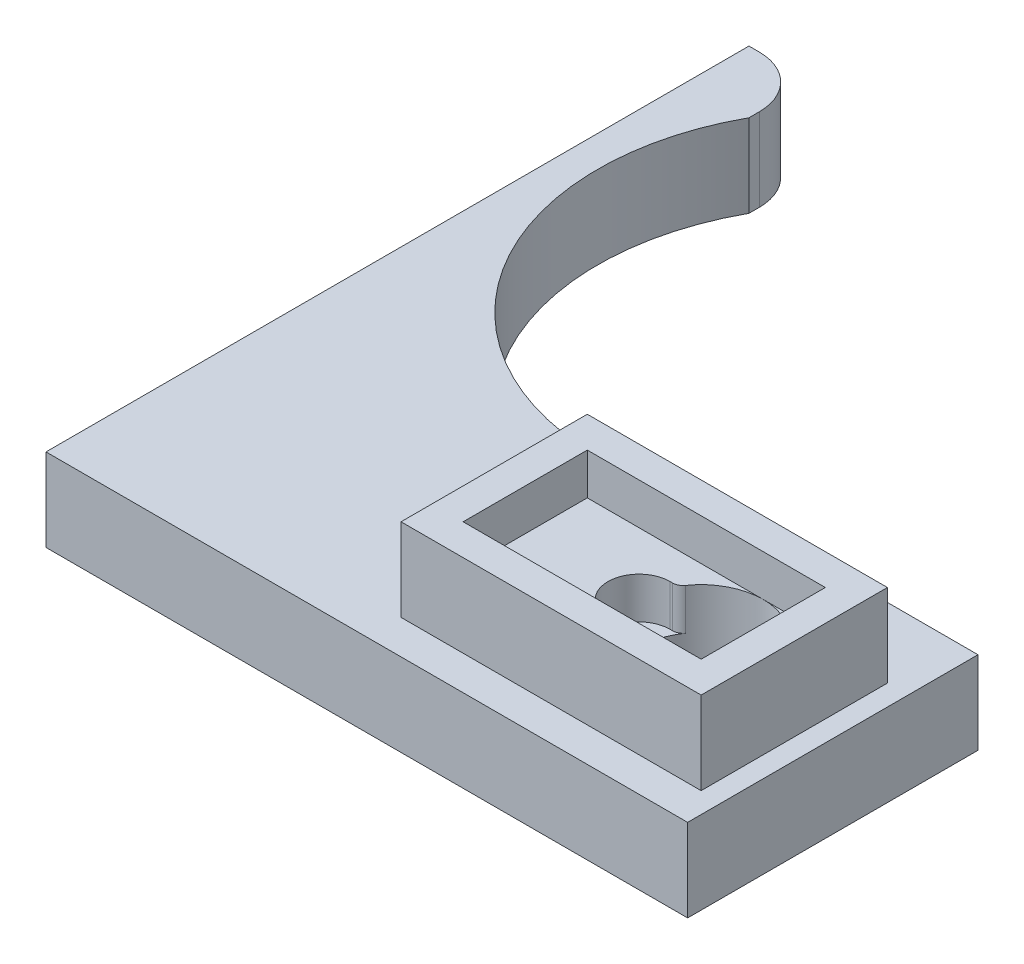
ISO-10303-21;
HEADER;
FILE_DESCRIPTION(('STEP AP214'),'2;1');
FILE_NAME('part.step','',(''),(''),'','','');
FILE_SCHEMA(('AUTOMOTIVE_DESIGN { 1 0 10303 214 1 1 1 1 }'));
ENDSEC;
DATA;
#1=APPLICATION_CONTEXT('core data for automotive mechanical design processes');
#2=APPLICATION_PROTOCOL_DEFINITION('international standard','automotive_design',2000,#1);
#3=PRODUCT_CONTEXT('',#1,'mechanical');
#4=PRODUCT('Part','Part','',(#3));
#5=PRODUCT_RELATED_PRODUCT_CATEGORY('part','',(#4));
#6=PRODUCT_DEFINITION_FORMATION('','',#4);
#7=PRODUCT_DEFINITION_CONTEXT('part definition',#1,'design');
#8=PRODUCT_DEFINITION('design','',#6,#7);
#9=PRODUCT_DEFINITION_SHAPE('','',#8);
#10=(LENGTH_UNIT() NAMED_UNIT(*) SI_UNIT(.MILLI.,.METRE.));
#11=(NAMED_UNIT(*) PLANE_ANGLE_UNIT() SI_UNIT($,.RADIAN.));
#12=(NAMED_UNIT(*) SI_UNIT($,.STERADIAN.) SOLID_ANGLE_UNIT());
#13=UNCERTAINTY_MEASURE_WITH_UNIT(LENGTH_MEASURE(1.E-05),#10,'distance_accuracy_value','');
#14=(GEOMETRIC_REPRESENTATION_CONTEXT(3) GLOBAL_UNCERTAINTY_ASSIGNED_CONTEXT((#13)) GLOBAL_UNIT_ASSIGNED_CONTEXT((#10,
#11,#12)) REPRESENTATION_CONTEXT('',''));
#15=CARTESIAN_POINT('',(0.,0.,0.));
#16=DIRECTION('',(0.,0.,1.));
#17=DIRECTION('',(1.,0.,0.));
#18=AXIS2_PLACEMENT_3D('',#15,#16,#17);
#19=CARTESIAN_POINT('',(0.,12.,0.));
#20=DIRECTION('',(0.,-1.,0.));
#21=DIRECTION('',(0.,0.,-1.));
#22=AXIS2_PLACEMENT_3D('',#19,#20,#21);
#23=PLANE('',#22);
#24=DIRECTION('',(-1.,0.,0.));
#25=VECTOR('',#24,1.);
#26=CARTESIAN_POINT('',(34.,12.,-18.3045831922197));
#27=LINE('',#26,#25);
#28=CARTESIAN_POINT('',(51.,12.,-18.3045831922197));
#29=VERTEX_POINT('',#28);
#30=CARTESIAN_POINT('',(34.,12.,-18.3045831922197));
#31=VERTEX_POINT('',#30);
#32=EDGE_CURVE('E302',#29,#31,#27,.T.);
#33=ORIENTED_EDGE('',*,*,#32,.T.);
#34=DIRECTION('',(0.,0.,1.));
#35=VECTOR('',#34,1.);
#36=CARTESIAN_POINT('',(34.,12.,-18.3045831922197));
#37=LINE('',#36,#35);
#38=CARTESIAN_POINT('',(34.,12.,-6.30458319221971));
#39=VERTEX_POINT('',#38);
#40=EDGE_CURVE('E278',#31,#39,#37,.T.);
#41=ORIENTED_EDGE('',*,*,#40,.T.);
#42=DIRECTION('',(1.,0.,0.));
#43=VECTOR('',#42,1.);
#44=CARTESIAN_POINT('',(34.,12.,-6.30458319221971));
#45=LINE('',#44,#43);
#46=CARTESIAN_POINT('',(51.,12.,-6.30458319221971));
#47=VERTEX_POINT('',#46);
#48=EDGE_CURVE('E292',#39,#47,#45,.T.);
#49=ORIENTED_EDGE('',*,*,#48,.T.);
#50=CARTESIAN_POINT('',(51.,12.,-12.3045831922197));
#51=DIRECTION('',(0.,-1.,0.));
#52=DIRECTION('',(0.,0.,-1.));
#53=AXIS2_PLACEMENT_3D('',#50,#51,#52);
#54=CIRCLE('',#53,5.99999999999999);
#55=CARTESIAN_POINT('',(46.0760891601103,12.,-8.87601176364829));
#56=VERTEX_POINT('',#55);
#57=EDGE_CURVE('E331',#47,#56,#54,.T.);
#58=ORIENTED_EDGE('',*,*,#57,.T.);
#59=CARTESIAN_POINT('',(45.255437353462,12.,-8.30458319221972));
#60=DIRECTION('',(0.,-1.,0.));
#61=DIRECTION('',(0.,0.,-1.));
#62=AXIS2_PLACEMENT_3D('',#59,#60,#61);
#63=CIRCLE('',#62,1.);
#64=CARTESIAN_POINT('',(45.255437353462,12.,-9.30458319221972));
#65=VERTEX_POINT('',#64);
#66=EDGE_CURVE('E335',#65,#56,#63,.T.);
#67=ORIENTED_EDGE('',*,*,#66,.F.);
#68=DIRECTION('',(1.,0.,0.));
#69=VECTOR('',#68,1.);
#70=CARTESIAN_POINT('',(45.,12.,-9.30458319221972));
#71=LINE('',#70,#69);
#72=CARTESIAN_POINT('',(45.,12.,-9.30458319221972));
#73=VERTEX_POINT('',#72);
#74=EDGE_CURVE('E339',#73,#65,#71,.T.);
#75=ORIENTED_EDGE('',*,*,#74,.F.);
#76=CARTESIAN_POINT('',(45.,12.,-12.3045831922197));
#77=DIRECTION('',(0.,1.,0.));
#78=DIRECTION('',(0.,0.,1.));
#79=AXIS2_PLACEMENT_3D('',#76,#77,#78);
#80=CIRCLE('',#79,3.);
#81=CARTESIAN_POINT('',(45.,12.,-15.3045831922197));
#82=VERTEX_POINT('',#81);
#83=EDGE_CURVE('E341',#82,#73,#80,.T.);
#84=ORIENTED_EDGE('',*,*,#83,.F.);
#85=DIRECTION('',(1.,0.,0.));
#86=VECTOR('',#85,1.);
#87=CARTESIAN_POINT('',(45.,12.,-15.3045831922197));
#88=LINE('',#87,#86);
#89=CARTESIAN_POINT('',(45.255437353462,12.,-15.3045831922197));
#90=VERTEX_POINT('',#89);
#91=EDGE_CURVE('E324',#82,#90,#88,.T.);
#92=ORIENTED_EDGE('',*,*,#91,.T.);
#93=CARTESIAN_POINT('',(45.255437353462,12.,-16.3045831922197));
#94=DIRECTION('',(0.,1.,0.));
#95=DIRECTION('',(0.,0.,1.));
#96=AXIS2_PLACEMENT_3D('',#93,#94,#95);
#97=CIRCLE('',#96,1.);
#98=CARTESIAN_POINT('',(46.0760891601103,12.,-15.7331546207911));
#99=VERTEX_POINT('',#98);
#100=EDGE_CURVE('E327',#90,#99,#97,.T.);
#101=ORIENTED_EDGE('',*,*,#100,.T.);
#102=EDGE_CURVE('E332',#99,#29,#54,.T.);
#103=ORIENTED_EDGE('',*,*,#102,.T.);
#104=EDGE_LOOP('',(#33,#41,#49,#58,#67,#75,#84,#92,#101,#103));
#105=FACE_BOUND('',#104,.T.);
#106=ADVANCED_FACE('F71',(#105),#23,.F.);
#107=CARTESIAN_POINT('',(57.,12.,-12.3045831922197));
#108=VERTEX_POINT('',#107);
#109=EDGE_CURVE('E815',#108,#47,#54,.T.);
#110=ORIENTED_EDGE('',*,*,#109,.T.);
#111=CARTESIAN_POINT('',(57.,12.,-6.30458319221971));
#112=VERTEX_POINT('',#111);
#113=EDGE_CURVE('E296',#47,#112,#45,.T.);
#114=ORIENTED_EDGE('',*,*,#113,.T.);
#115=DIRECTION('',(0.,0.,-1.));
#116=VECTOR('',#115,1.);
#117=CARTESIAN_POINT('',(57.,12.,-18.3045831922197));
#118=LINE('',#117,#116);
#119=EDGE_CURVE('E295',#112,#108,#118,.T.);
#120=ORIENTED_EDGE('',*,*,#119,.T.);
#121=EDGE_LOOP('',(#110,#114,#120));
#122=FACE_BOUND('',#121,.T.);
#123=ADVANCED_FACE('F506',(#122),#23,.F.);
#124=CARTESIAN_POINT('',(1.,8.,-62.923533230842));
#125=DIRECTION('',(0.,-1.,0.));
#126=DIRECTION('',(0.,0.,-1.));
#127=AXIS2_PLACEMENT_3D('',#124,#125,#126);
#128=PLANE('',#127);
#129=DIRECTION('',(0.,0.,1.));
#130=VECTOR('',#129,1.);
#131=CARTESIAN_POINT('',(0.,8.,0.));
#132=LINE('',#131,#130);
#133=CARTESIAN_POINT('',(0.,8.,-67.923533230842));
#134=VERTEX_POINT('',#133);
#135=CARTESIAN_POINT('',(0.,8.,0.));
#136=VERTEX_POINT('',#135);
#137=EDGE_CURVE('E398',#134,#136,#132,.T.);
#138=ORIENTED_EDGE('',*,*,#137,.T.);
#139=DIRECTION('',(1.,0.,0.));
#140=VECTOR('',#139,1.);
#141=CARTESIAN_POINT('',(0.,8.,0.));
#142=LINE('',#141,#140);
#143=CARTESIAN_POINT('',(62.,8.,0.));
#144=VERTEX_POINT('',#143);
#145=EDGE_CURVE('E401',#136,#144,#142,.T.);
#146=ORIENTED_EDGE('',*,*,#145,.T.);
#147=DIRECTION('',(0.,0.,-1.));
#148=VECTOR('',#147,1.);
#149=CARTESIAN_POINT('',(62.,8.,-28.0559877309327));
#150=LINE('',#149,#148);
#151=CARTESIAN_POINT('',(62.,8.,-28.0559877309327));
#152=VERTEX_POINT('',#151);
#153=EDGE_CURVE('E404',#144,#152,#150,.T.);
#154=ORIENTED_EDGE('',*,*,#153,.T.);
#155=DIRECTION('',(-1.,0.,0.));
#156=VECTOR('',#155,1.);
#157=CARTESIAN_POINT('',(36.,8.,-28.0559877309327));
#158=LINE('',#157,#156);
#159=CARTESIAN_POINT('',(36.,8.,-28.0559877309327));
#160=VERTEX_POINT('',#159);
#161=EDGE_CURVE('E406',#152,#160,#158,.T.);
#162=ORIENTED_EDGE('',*,*,#161,.T.);
#163=CARTESIAN_POINT('',(27.,8.,-50.3045831922197));
#164=DIRECTION('',(0.,-1.,0.));
#165=DIRECTION('',(0.,0.,1.));
#166=AXIS2_PLACEMENT_3D('',#163,#164,#165);
#167=CIRCLE('',#166,24.);
#168=CARTESIAN_POINT('',(6.,8.,-61.923533230842));
#169=VERTEX_POINT('',#168);
#170=EDGE_CURVE('E408',#160,#169,#167,.T.);
#171=ORIENTED_EDGE('',*,*,#170,.T.);
#172=DIRECTION('',(0.,0.,-1.));
#173=VECTOR('',#172,1.);
#174=CARTESIAN_POINT('',(6.,8.,-61.923533230842));
#175=LINE('',#174,#173);
#176=CARTESIAN_POINT('',(6.,8.,-62.9235332308419));
#177=VERTEX_POINT('',#176);
#178=EDGE_CURVE('E410',#169,#177,#175,.T.);
#179=ORIENTED_EDGE('',*,*,#178,.T.);
#180=CARTESIAN_POINT('',(1.,8.,-62.923533230842));
#181=DIRECTION('',(0.,1.,0.));
#182=DIRECTION('',(0.,0.,-1.));
#183=AXIS2_PLACEMENT_3D('',#180,#181,#182);
#184=CIRCLE('',#183,5.);
#185=CARTESIAN_POINT('',(0.999999999999964,8.,-67.923533230842));
#186=VERTEX_POINT('',#185);
#187=EDGE_CURVE('E412',#177,#186,#184,.T.);
#188=ORIENTED_EDGE('',*,*,#187,.T.);
#189=DIRECTION('',(-1.,0.,0.));
#190=VECTOR('',#189,1.);
#191=CARTESIAN_POINT('',(0.,8.,-67.923533230842));
#192=LINE('',#191,#190);
#193=EDGE_CURVE('E414',#186,#134,#192,.T.);
#194=ORIENTED_EDGE('',*,*,#193,.T.);
#195=EDGE_LOOP('',(#138,#146,#154,#162,#171,#179,#188,#194));
#196=FACE_BOUND('',#195,.T.);
#197=DIRECTION('',(1.,0.,0.));
#198=VECTOR('',#197,1.);
#199=CARTESIAN_POINT('',(31.,8.,-3.30458319221972));
#200=LINE('',#199,#198);
#201=CARTESIAN_POINT('',(31.,8.,-3.30458319221972));
#202=VERTEX_POINT('',#201);
#203=CARTESIAN_POINT('',(60.,8.,-3.30458319221972));
#204=VERTEX_POINT('',#203);
#205=EDGE_CURVE('E357',#202,#204,#200,.T.);
#206=ORIENTED_EDGE('',*,*,#205,.F.);
#207=DIRECTION('',(0.,0.,1.));
#208=VECTOR('',#207,1.);
#209=CARTESIAN_POINT('',(31.,8.,-21.3045831922197));
#210=LINE('',#209,#208);
#211=CARTESIAN_POINT('',(31.,8.,-21.3045831922197));
#212=VERTEX_POINT('',#211);
#213=EDGE_CURVE('E379',#212,#202,#210,.T.);
#214=ORIENTED_EDGE('',*,*,#213,.F.);
#215=DIRECTION('',(1.,0.,0.));
#216=VECTOR('',#215,1.);
#217=CARTESIAN_POINT('',(31.,8.,-21.3045831922197));
#218=LINE('',#217,#216);
#219=CARTESIAN_POINT('',(60.,8.,-21.3045831922197));
#220=VERTEX_POINT('',#219);
#221=EDGE_CURVE('E376',#212,#220,#218,.T.);
#222=ORIENTED_EDGE('',*,*,#221,.T.);
#223=DIRECTION('',(0.,0.,1.));
#224=VECTOR('',#223,1.);
#225=CARTESIAN_POINT('',(60.,8.,-21.3045831922197));
#226=LINE('',#225,#224);
#227=EDGE_CURVE('E373',#220,#204,#226,.T.);
#228=ORIENTED_EDGE('',*,*,#227,.T.);
#229=EDGE_LOOP('',(#206,#214,#222,#228));
#230=FACE_BOUND('',#229,.T.);
#231=ADVANCED_FACE('F502',(#196,#230),#128,.F.);
#232=DIRECTION('',(1.,0.,0.));
#233=VECTOR('',#232,1.);
#234=CARTESIAN_POINT('',(45.,8.,-9.30458319221972));
#235=LINE('',#234,#233);
#236=CARTESIAN_POINT('',(45.,8.,-9.30458319221972));
#237=VERTEX_POINT('',#236);
#238=CARTESIAN_POINT('',(45.255437353462,8.,-9.30458319221972));
#239=VERTEX_POINT('',#238);
#240=EDGE_CURVE('E351',#237,#239,#235,.T.);
#241=ORIENTED_EDGE('',*,*,#240,.T.);
#242=CARTESIAN_POINT('',(45.255437353462,8.,-8.30458319221972));
#243=DIRECTION('',(0.,-1.,0.));
#244=DIRECTION('',(0.,0.,-1.));
#245=AXIS2_PLACEMENT_3D('',#242,#243,#244);
#246=CIRCLE('',#245,1.);
#247=CARTESIAN_POINT('',(46.0760891601103,8.,-8.87601176364829));
#248=VERTEX_POINT('',#247);
#249=EDGE_CURVE('E349',#239,#248,#246,.T.);
#250=ORIENTED_EDGE('',*,*,#249,.T.);
#251=CARTESIAN_POINT('',(51.,8.,-12.3045831922197));
#252=DIRECTION('',(0.,1.,0.));
#253=DIRECTION('',(0.,0.,1.));
#254=AXIS2_PLACEMENT_3D('',#251,#252,#253);
#255=CIRCLE('',#254,5.99999999999999);
#256=CARTESIAN_POINT('',(46.0760891601103,8.,-15.7331546207911));
#257=VERTEX_POINT('',#256);
#258=EDGE_CURVE('E392',#257,#248,#255,.T.);
#259=ORIENTED_EDGE('',*,*,#258,.F.);
#260=CARTESIAN_POINT('',(45.255437353462,8.,-16.3045831922197));
#261=DIRECTION('',(0.,1.,0.));
#262=DIRECTION('',(0.,0.,1.));
#263=AXIS2_PLACEMENT_3D('',#260,#261,#262);
#264=CIRCLE('',#263,1.);
#265=CARTESIAN_POINT('',(45.255437353462,8.,-15.3045831922197));
#266=VERTEX_POINT('',#265);
#267=EDGE_CURVE('E346',#266,#257,#264,.T.);
#268=ORIENTED_EDGE('',*,*,#267,.F.);
#269=DIRECTION('',(1.,0.,0.));
#270=VECTOR('',#269,1.);
#271=CARTESIAN_POINT('',(45.,8.,-15.3045831922197));
#272=LINE('',#271,#270);
#273=CARTESIAN_POINT('',(45.,8.,-15.3045831922197));
#274=VERTEX_POINT('',#273);
#275=EDGE_CURVE('E323',#274,#266,#272,.T.);
#276=ORIENTED_EDGE('',*,*,#275,.F.);
#277=CARTESIAN_POINT('',(45.,8.,-12.3045831922197));
#278=DIRECTION('',(0.,1.,0.));
#279=DIRECTION('',(0.,0.,1.));
#280=AXIS2_PLACEMENT_3D('',#277,#278,#279);
#281=CIRCLE('',#280,3.);
#282=EDGE_CURVE('E328',#274,#237,#281,.T.);
#283=ORIENTED_EDGE('',*,*,#282,.T.);
#284=EDGE_LOOP('',(#241,#250,#259,#268,#276,#283));
#285=FACE_BOUND('',#284,.T.);
#286=ADVANCED_FACE('F505',(#285),#128,.F.);
#287=CARTESIAN_POINT('',(1.,0.,-62.923533230842));
#288=DIRECTION('',(0.,-1.,0.));
#289=DIRECTION('',(0.,0.,-1.));
#290=AXIS2_PLACEMENT_3D('',#287,#288,#289);
#291=PLANE('',#290);
#292=DIRECTION('',(-0.20791169081776,0.,0.978147600733805));
#293=VECTOR('',#292,1.);
#294=CARTESIAN_POINT('',(55.1937036086913,0.,-16.1622841222414));
#295=LINE('',#294,#293);
#296=CARTESIAN_POINT('',(57.721788353277,0.,-28.0559877309327));
#297=VERTEX_POINT('',#296);
#298=CARTESIAN_POINT('',(55.2697300548974,0.,-16.5199604301791));
#299=VERTEX_POINT('',#298);
#300=EDGE_CURVE('E259',#297,#299,#295,.T.);
#301=ORIENTED_EDGE('',*,*,#300,.F.);
#302=DIRECTION('',(-1.,0.,0.));
#303=VECTOR('',#302,1.);
#304=CARTESIAN_POINT('',(36.,0.,-28.0559877309327));
#305=LINE('',#304,#303);
#306=CARTESIAN_POINT('',(62.,0.,-28.0559877309327));
#307=VERTEX_POINT('',#306);
#308=EDGE_CURVE('E424',#307,#297,#305,.T.);
#309=ORIENTED_EDGE('',*,*,#308,.F.);
#310=DIRECTION('',(0.,0.,-1.));
#311=VECTOR('',#310,1.);
#312=CARTESIAN_POINT('',(62.,0.,-28.0559877309327));
#313=LINE('',#312,#311);
#314=CARTESIAN_POINT('',(62.,0.,0.));
#315=VERTEX_POINT('',#314);
#316=EDGE_CURVE('E421',#315,#307,#313,.T.);
#317=ORIENTED_EDGE('',*,*,#316,.F.);
#318=DIRECTION('',(1.,0.,0.));
#319=VECTOR('',#318,1.);
#320=CARTESIAN_POINT('',(36.,0.,0.));
#321=LINE('',#320,#319);
#322=CARTESIAN_POINT('',(0.,0.,0.));
#323=VERTEX_POINT('',#322);
#324=EDGE_CURVE('E419',#323,#315,#321,.T.);
#325=ORIENTED_EDGE('',*,*,#324,.F.);
#326=DIRECTION('',(0.,0.,1.));
#327=VECTOR('',#326,1.);
#328=CARTESIAN_POINT('',(0.,0.,0.));
#329=LINE('',#328,#327);
#330=CARTESIAN_POINT('',(0.,0.,-67.923533230842));
#331=VERTEX_POINT('',#330);
#332=EDGE_CURVE('E395',#331,#323,#329,.T.);
#333=ORIENTED_EDGE('',*,*,#332,.F.);
#334=DIRECTION('',(-1.,0.,0.));
#335=VECTOR('',#334,1.);
#336=CARTESIAN_POINT('',(0.,0.,-67.923533230842));
#337=LINE('',#336,#335);
#338=CARTESIAN_POINT('',(0.999999999999964,0.,-67.923533230842));
#339=VERTEX_POINT('',#338);
#340=EDGE_CURVE('E402',#339,#331,#337,.T.);
#341=ORIENTED_EDGE('',*,*,#340,.F.);
#342=CARTESIAN_POINT('',(1.,0.,-62.923533230842));
#343=DIRECTION('',(0.,1.,0.));
#344=DIRECTION('',(0.,0.,-1.));
#345=AXIS2_PLACEMENT_3D('',#342,#343,#344);
#346=CIRCLE('',#345,5.);
#347=CARTESIAN_POINT('',(6.,0.,-62.9235332308419));
#348=VERTEX_POINT('',#347);
#349=EDGE_CURVE('E430',#348,#339,#346,.T.);
#350=ORIENTED_EDGE('',*,*,#349,.F.);
#351=DIRECTION('',(0.,0.,-1.));
#352=VECTOR('',#351,1.);
#353=CARTESIAN_POINT('',(6.,0.,-61.923533230842));
#354=LINE('',#353,#352);
#355=CARTESIAN_POINT('',(6.,0.,-61.923533230842));
#356=VERTEX_POINT('',#355);
#357=EDGE_CURVE('E428',#356,#348,#354,.T.);
#358=ORIENTED_EDGE('',*,*,#357,.F.);
#359=CARTESIAN_POINT('',(27.,0.,-50.3045831922197));
#360=DIRECTION('',(0.,-1.,0.));
#361=DIRECTION('',(0.,0.,1.));
#362=AXIS2_PLACEMENT_3D('',#359,#360,#361);
#363=CIRCLE('',#362,24.);
#364=CARTESIAN_POINT('',(36.,0.,-28.0559877309327));
#365=VERTEX_POINT('',#364);
#366=EDGE_CURVE('E426',#365,#356,#363,.T.);
#367=ORIENTED_EDGE('',*,*,#366,.F.);
#368=CARTESIAN_POINT('',(44.278211646723,0.,-28.0559877309327));
#369=VERTEX_POINT('',#368);
#370=EDGE_CURVE('E423',#369,#365,#305,.T.);
#371=ORIENTED_EDGE('',*,*,#370,.F.);
#372=DIRECTION('',(-0.20791169081776,0.,-0.978147600733805));
#373=VECTOR('',#372,1.);
#374=CARTESIAN_POINT('',(46.8062963913087,0.,-16.1622841222414));
#375=LINE('',#374,#373);
#376=CARTESIAN_POINT('',(46.7302699451027,0.,-16.5199604301791));
#377=VERTEX_POINT('',#376);
#378=EDGE_CURVE('E265',#377,#369,#375,.T.);
#379=ORIENTED_EDGE('',*,*,#378,.F.);
#380=CARTESIAN_POINT('',(51.,0.,-12.3045831922197));
#381=DIRECTION('',(0.,1.,0.));
#382=DIRECTION('',(0.,0.,1.));
#383=AXIS2_PLACEMENT_3D('',#380,#381,#382);
#384=CIRCLE('',#383,5.99999999999999);
#385=EDGE_CURVE('E391',#377,#299,#384,.T.);
#386=ORIENTED_EDGE('',*,*,#385,.T.);
#387=EDGE_LOOP('',(#301,#309,#317,#325,#333,#341,#350,#358,#367,#371,#379,#386));
#388=FACE_BOUND('',#387,.T.);
#389=ADVANCED_FACE('F460',(#388),#291,.T.);
#390=CARTESIAN_POINT('',(0.,8.,0.));
#391=DIRECTION('',(1.,0.,0.));
#392=DIRECTION('',(0.,0.,-1.));
#393=AXIS2_PLACEMENT_3D('',#390,#391,#392);
#394=PLANE('',#393);
#395=ORIENTED_EDGE('',*,*,#332,.T.);
#396=DIRECTION('',(0.,-1.,0.));
#397=VECTOR('',#396,1.);
#398=CARTESIAN_POINT('',(0.,8.,0.));
#399=LINE('',#398,#397);
#400=EDGE_CURVE('E453',#136,#323,#399,.T.);
#401=ORIENTED_EDGE('',*,*,#400,.F.);
#402=ORIENTED_EDGE('',*,*,#137,.F.);
#403=DIRECTION('',(0.,-1.,0.));
#404=VECTOR('',#403,1.);
#405=CARTESIAN_POINT('',(0.,8.,-67.923533230842));
#406=LINE('',#405,#404);
#407=EDGE_CURVE('E416',#134,#331,#406,.T.);
#408=ORIENTED_EDGE('',*,*,#407,.T.);
#409=EDGE_LOOP('',(#395,#401,#402,#408));
#410=FACE_BOUND('',#409,.T.);
#411=ADVANCED_FACE('F73',(#410),#394,.F.);
#412=CARTESIAN_POINT('',(36.,8.,0.));
#413=DIRECTION('',(0.,0.,-1.));
#414=DIRECTION('',(-1.,0.,0.));
#415=AXIS2_PLACEMENT_3D('',#412,#413,#414);
#416=PLANE('',#415);
#417=ORIENTED_EDGE('',*,*,#324,.T.);
#418=DIRECTION('',(0.,-1.,0.));
#419=VECTOR('',#418,1.);
#420=CARTESIAN_POINT('',(62.,8.,0.));
#421=LINE('',#420,#419);
#422=EDGE_CURVE('E450',#144,#315,#421,.T.);
#423=ORIENTED_EDGE('',*,*,#422,.F.);
#424=ORIENTED_EDGE('',*,*,#145,.F.);
#425=ORIENTED_EDGE('',*,*,#400,.T.);
#426=EDGE_LOOP('',(#417,#423,#424,#425));
#427=FACE_BOUND('',#426,.T.);
#428=ADVANCED_FACE('F480',(#427),#416,.F.);
#429=CARTESIAN_POINT('',(62.,8.,-28.0559877309327));
#430=DIRECTION('',(-1.,0.,0.));
#431=DIRECTION('',(0.,0.,1.));
#432=AXIS2_PLACEMENT_3D('',#429,#430,#431);
#433=PLANE('',#432);
#434=ORIENTED_EDGE('',*,*,#316,.T.);
#435=DIRECTION('',(0.,-1.,0.));
#436=VECTOR('',#435,1.);
#437=CARTESIAN_POINT('',(62.,8.,-28.0559877309327));
#438=LINE('',#437,#436);
#439=EDGE_CURVE('E447',#152,#307,#438,.T.);
#440=ORIENTED_EDGE('',*,*,#439,.F.);
#441=ORIENTED_EDGE('',*,*,#153,.F.);
#442=ORIENTED_EDGE('',*,*,#422,.T.);
#443=EDGE_LOOP('',(#434,#440,#441,#442));
#444=FACE_BOUND('',#443,.T.);
#445=ADVANCED_FACE('F474',(#444),#433,.F.);
#446=CARTESIAN_POINT('',(36.,8.,-28.0559877309327));
#447=DIRECTION('',(0.,0.,1.));
#448=DIRECTION('',(1.,0.,0.));
#449=AXIS2_PLACEMENT_3D('',#446,#447,#448);
#450=PLANE('',#449);
#451=ORIENTED_EDGE('',*,*,#308,.T.);
#452=DIRECTION('',(0.,-1.,0.));
#453=VECTOR('',#452,1.);
#454=CARTESIAN_POINT('',(57.721788353277,4.,-28.0559877309327));
#455=LINE('',#454,#453);
#456=CARTESIAN_POINT('',(57.721788353277,4.,-28.0559877309327));
#457=VERTEX_POINT('',#456);
#458=EDGE_CURVE('E268',#457,#297,#455,.T.);
#459=ORIENTED_EDGE('',*,*,#458,.F.);
#460=DIRECTION('',(1.,0.,0.));
#461=VECTOR('',#460,1.);
#462=CARTESIAN_POINT('',(44.278211646723,4.,-28.0559877309327));
#463=LINE('',#462,#461);
#464=CARTESIAN_POINT('',(44.278211646723,4.,-28.0559877309327));
#465=VERTEX_POINT('',#464);
#466=EDGE_CURVE('E254',#465,#457,#463,.T.);
#467=ORIENTED_EDGE('',*,*,#466,.F.);
#468=DIRECTION('',(0.,-1.,0.));
#469=VECTOR('',#468,1.);
#470=CARTESIAN_POINT('',(44.278211646723,4.,-28.0559877309327));
#471=LINE('',#470,#469);
#472=EDGE_CURVE('E262',#465,#369,#471,.T.);
#473=ORIENTED_EDGE('',*,*,#472,.T.);
#474=ORIENTED_EDGE('',*,*,#370,.T.);
#475=DIRECTION('',(0.,-1.,0.));
#476=VECTOR('',#475,1.);
#477=CARTESIAN_POINT('',(36.,8.,-28.0559877309327));
#478=LINE('',#477,#476);
#479=EDGE_CURVE('E444',#160,#365,#478,.T.);
#480=ORIENTED_EDGE('',*,*,#479,.F.);
#481=ORIENTED_EDGE('',*,*,#161,.F.);
#482=ORIENTED_EDGE('',*,*,#439,.T.);
#483=EDGE_LOOP('',(#451,#459,#467,#473,#474,#480,#481,#482));
#484=FACE_BOUND('',#483,.T.);
#485=ADVANCED_FACE('F272',(#484),#450,.F.);
#486=CARTESIAN_POINT('',(27.,8.,-50.3045831922197));
#487=DIRECTION('',(0.,-1.,0.));
#488=DIRECTION('',(0.,0.,-1.));
#489=AXIS2_PLACEMENT_3D('',#486,#487,#488);
#490=CYLINDRICAL_SURFACE('',#489,24.);
#491=ORIENTED_EDGE('',*,*,#366,.T.);
#492=DIRECTION('',(0.,-1.,0.));
#493=VECTOR('',#492,1.);
#494=CARTESIAN_POINT('',(6.,8.,-61.923533230842));
#495=LINE('',#494,#493);
#496=EDGE_CURVE('E441',#169,#356,#495,.T.);
#497=ORIENTED_EDGE('',*,*,#496,.F.);
#498=ORIENTED_EDGE('',*,*,#170,.F.);
#499=ORIENTED_EDGE('',*,*,#479,.T.);
#500=EDGE_LOOP('',(#491,#497,#498,#499));
#501=FACE_BOUND('',#500,.T.);
#502=ADVANCED_FACE('F500',(#501),#490,.F.);
#503=CARTESIAN_POINT('',(6.,8.,-61.923533230842));
#504=DIRECTION('',(-1.,0.,0.));
#505=DIRECTION('',(0.,0.,1.));
#506=AXIS2_PLACEMENT_3D('',#503,#504,#505);
#507=PLANE('',#506);
#508=ORIENTED_EDGE('',*,*,#357,.T.);
#509=DIRECTION('',(0.,-1.,0.));
#510=VECTOR('',#509,1.);
#511=CARTESIAN_POINT('',(6.,8.,-62.9235332308419));
#512=LINE('',#511,#510);
#513=EDGE_CURVE('E438',#177,#348,#512,.T.);
#514=ORIENTED_EDGE('',*,*,#513,.F.);
#515=ORIENTED_EDGE('',*,*,#178,.F.);
#516=ORIENTED_EDGE('',*,*,#496,.T.);
#517=EDGE_LOOP('',(#508,#514,#515,#516));
#518=FACE_BOUND('',#517,.T.);
#519=ADVANCED_FACE('F496',(#518),#507,.F.);
#520=CARTESIAN_POINT('',(1.,8.,-62.923533230842));
#521=DIRECTION('',(0.,-1.,0.));
#522=DIRECTION('',(0.,0.,-1.));
#523=AXIS2_PLACEMENT_3D('',#520,#521,#522);
#524=CYLINDRICAL_SURFACE('',#523,5.);
#525=ORIENTED_EDGE('',*,*,#349,.T.);
#526=DIRECTION('',(0.,-1.,0.));
#527=VECTOR('',#526,1.);
#528=CARTESIAN_POINT('',(0.999999999999964,8.,-67.923533230842));
#529=LINE('',#528,#527);
#530=EDGE_CURVE('E435',#186,#339,#529,.T.);
#531=ORIENTED_EDGE('',*,*,#530,.F.);
#532=ORIENTED_EDGE('',*,*,#187,.F.);
#533=ORIENTED_EDGE('',*,*,#513,.T.);
#534=EDGE_LOOP('',(#525,#531,#532,#533));
#535=FACE_BOUND('',#534,.T.);
#536=ADVANCED_FACE('F491',(#535),#524,.T.);
#537=CARTESIAN_POINT('',(0.,8.,-67.923533230842));
#538=DIRECTION('',(0.,0.,1.));
#539=DIRECTION('',(1.,0.,0.));
#540=AXIS2_PLACEMENT_3D('',#537,#538,#539);
#541=PLANE('',#540);
#542=ORIENTED_EDGE('',*,*,#340,.T.);
#543=ORIENTED_EDGE('',*,*,#407,.F.);
#544=ORIENTED_EDGE('',*,*,#193,.F.);
#545=ORIENTED_EDGE('',*,*,#530,.T.);
#546=EDGE_LOOP('',(#542,#543,#544,#545));
#547=FACE_BOUND('',#546,.T.);
#548=ADVANCED_FACE('F486',(#547),#541,.F.);
#549=CARTESIAN_POINT('',(51.,8.,-12.3045831922197));
#550=DIRECTION('',(0.,-1.,0.));
#551=DIRECTION('',(0.,0.,-1.));
#552=AXIS2_PLACEMENT_3D('',#549,#550,#551);
#553=CYLINDRICAL_SURFACE('',#552,5.99999999999999);
#554=DIRECTION('',(0.,-1.,0.));
#555=VECTOR('',#554,1.);
#556=CARTESIAN_POINT('',(55.2697300548974,8.,-16.5199604301791));
#557=LINE('',#556,#555);
#558=CARTESIAN_POINT('',(55.2697300548974,4.,-16.5199604301791));
#559=VERTEX_POINT('',#558);
#560=EDGE_CURVE('E12',#299,#559,#557,.F.);
#561=ORIENTED_EDGE('',*,*,#560,.F.);
#562=ORIENTED_EDGE('',*,*,#385,.F.);
#563=DIRECTION('',(0.,-1.,0.));
#564=VECTOR('',#563,1.);
#565=CARTESIAN_POINT('',(46.7302699451027,8.,-16.5199604301791));
#566=LINE('',#565,#564);
#567=CARTESIAN_POINT('',(46.7302699451027,4.,-16.5199604301791));
#568=VERTEX_POINT('',#567);
#569=EDGE_CURVE('E79',#568,#377,#566,.T.);
#570=ORIENTED_EDGE('',*,*,#569,.F.);
#571=CARTESIAN_POINT('',(51.,4.,-12.3045831922197));
#572=DIRECTION('',(0.,-1.,0.));
#573=DIRECTION('',(0.,0.,-1.));
#574=AXIS2_PLACEMENT_3D('',#571,#572,#573);
#575=CIRCLE('',#574,5.99999999999999);
#576=EDGE_CURVE('E256',#568,#559,#575,.T.);
#577=ORIENTED_EDGE('',*,*,#576,.T.);
#578=EDGE_LOOP('',(#561,#562,#570,#577));
#579=FACE_BOUND('',#578,.T.);
#580=ORIENTED_EDGE('',*,*,#258,.T.);
#581=DIRECTION('',(0.,-1.,0.));
#582=VECTOR('',#581,1.);
#583=CARTESIAN_POINT('',(46.0760891601103,12.,-8.87601176364829));
#584=LINE('',#583,#582);
#585=EDGE_CURVE('E364',#56,#248,#584,.T.);
#586=ORIENTED_EDGE('',*,*,#585,.F.);
#587=ORIENTED_EDGE('',*,*,#57,.F.);
#588=ORIENTED_EDGE('',*,*,#109,.F.);
#589=EDGE_CURVE('E336',#29,#108,#54,.T.);
#590=ORIENTED_EDGE('',*,*,#589,.F.);
#591=ORIENTED_EDGE('',*,*,#102,.F.);
#592=DIRECTION('',(0.,-1.,0.));
#593=VECTOR('',#592,1.);
#594=CARTESIAN_POINT('',(46.0760891601103,12.,-15.7331546207911));
#595=LINE('',#594,#593);
#596=EDGE_CURVE('E367',#99,#257,#595,.T.);
#597=ORIENTED_EDGE('',*,*,#596,.T.);
#598=EDGE_LOOP('',(#580,#586,#587,#588,#590,#591,#597));
#599=FACE_BOUND('',#598,.T.);
#600=ADVANCED_FACE('F463',(#579,#599),#553,.F.);
#601=CARTESIAN_POINT('',(31.,12.,-3.30458319221972));
#602=DIRECTION('',(0.,0.,-1.));
#603=DIRECTION('',(-1.,0.,0.));
#604=AXIS2_PLACEMENT_3D('',#601,#602,#603);
#605=PLANE('',#604);
#606=ORIENTED_EDGE('',*,*,#205,.T.);
#607=DIRECTION('',(0.,-1.,0.));
#608=VECTOR('',#607,1.);
#609=CARTESIAN_POINT('',(60.,12.,-3.30458319221972));
#610=LINE('',#609,#608);
#611=CARTESIAN_POINT('',(60.,16.,-3.30458319221972));
#612=VERTEX_POINT('',#611);
#613=EDGE_CURVE('E388',#612,#204,#610,.T.);
#614=ORIENTED_EDGE('',*,*,#613,.F.);
#615=DIRECTION('',(1.,0.,0.));
#616=VECTOR('',#615,1.);
#617=CARTESIAN_POINT('',(31.,16.,-3.30458319221972));
#618=LINE('',#617,#616);
#619=CARTESIAN_POINT('',(31.,16.,-3.30458319221972));
#620=VERTEX_POINT('',#619);
#621=EDGE_CURVE('E314',#620,#612,#618,.T.);
#622=ORIENTED_EDGE('',*,*,#621,.F.);
#623=DIRECTION('',(0.,-1.,0.));
#624=VECTOR('',#623,1.);
#625=CARTESIAN_POINT('',(31.,12.,-3.30458319221972));
#626=LINE('',#625,#624);
#627=EDGE_CURVE('E381',#620,#202,#626,.T.);
#628=ORIENTED_EDGE('',*,*,#627,.T.);
#629=EDGE_LOOP('',(#606,#614,#622,#628));
#630=FACE_BOUND('',#629,.T.);
#631=ADVANCED_FACE('F512',(#630),#605,.F.);
#632=CARTESIAN_POINT('',(60.,12.,-21.3045831922197));
#633=DIRECTION('',(1.,0.,0.));
#634=DIRECTION('',(0.,0.,-1.));
#635=AXIS2_PLACEMENT_3D('',#632,#633,#634);
#636=PLANE('',#635);
#637=ORIENTED_EDGE('',*,*,#227,.F.);
#638=DIRECTION('',(0.,-1.,0.));
#639=VECTOR('',#638,1.);
#640=CARTESIAN_POINT('',(60.,12.,-21.3045831922197));
#641=LINE('',#640,#639);
#642=CARTESIAN_POINT('',(60.,16.,-21.3045831922197));
#643=VERTEX_POINT('',#642);
#644=EDGE_CURVE('E386',#643,#220,#641,.T.);
#645=ORIENTED_EDGE('',*,*,#644,.F.);
#646=DIRECTION('',(0.,0.,-1.));
#647=VECTOR('',#646,1.);
#648=CARTESIAN_POINT('',(60.,16.,-21.3045831922197));
#649=LINE('',#648,#647);
#650=EDGE_CURVE('E317',#612,#643,#649,.T.);
#651=ORIENTED_EDGE('',*,*,#650,.F.);
#652=ORIENTED_EDGE('',*,*,#613,.T.);
#653=EDGE_LOOP('',(#637,#645,#651,#652));
#654=FACE_BOUND('',#653,.T.);
#655=ADVANCED_FACE('F516',(#654),#636,.T.);
#656=CARTESIAN_POINT('',(31.,12.,-21.3045831922197));
#657=DIRECTION('',(0.,0.,-1.));
#658=DIRECTION('',(-1.,0.,0.));
#659=AXIS2_PLACEMENT_3D('',#656,#657,#658);
#660=PLANE('',#659);
#661=ORIENTED_EDGE('',*,*,#221,.F.);
#662=DIRECTION('',(0.,-1.,0.));
#663=VECTOR('',#662,1.);
#664=CARTESIAN_POINT('',(31.,12.,-21.3045831922197));
#665=LINE('',#664,#663);
#666=CARTESIAN_POINT('',(31.,16.,-21.3045831922197));
#667=VERTEX_POINT('',#666);
#668=EDGE_CURVE('E384',#667,#212,#665,.T.);
#669=ORIENTED_EDGE('',*,*,#668,.F.);
#670=DIRECTION('',(-1.,0.,0.));
#671=VECTOR('',#670,1.);
#672=CARTESIAN_POINT('',(31.,16.,-21.3045831922197));
#673=LINE('',#672,#671);
#674=EDGE_CURVE('E320',#643,#667,#673,.T.);
#675=ORIENTED_EDGE('',*,*,#674,.F.);
#676=ORIENTED_EDGE('',*,*,#644,.T.);
#677=EDGE_LOOP('',(#661,#669,#675,#676));
#678=FACE_BOUND('',#677,.T.);
#679=ADVANCED_FACE('F524',(#678),#660,.T.);
#680=CARTESIAN_POINT('',(31.,12.,-21.3045831922197));
#681=DIRECTION('',(1.,0.,0.));
#682=DIRECTION('',(0.,0.,-1.));
#683=AXIS2_PLACEMENT_3D('',#680,#681,#682);
#684=PLANE('',#683);
#685=ORIENTED_EDGE('',*,*,#213,.T.);
#686=ORIENTED_EDGE('',*,*,#627,.F.);
#687=DIRECTION('',(0.,0.,1.));
#688=VECTOR('',#687,1.);
#689=CARTESIAN_POINT('',(31.,16.,-21.3045831922197));
#690=LINE('',#689,#688);
#691=EDGE_CURVE('E311',#667,#620,#690,.T.);
#692=ORIENTED_EDGE('',*,*,#691,.F.);
#693=ORIENTED_EDGE('',*,*,#668,.T.);
#694=EDGE_LOOP('',(#685,#686,#692,#693));
#695=FACE_BOUND('',#694,.T.);
#696=ADVANCED_FACE('F526',(#695),#684,.F.);
#697=ORIENTED_EDGE('',*,*,#589,.T.);
#698=CARTESIAN_POINT('',(57.,12.,-18.3045831922197));
#699=VERTEX_POINT('',#698);
#700=EDGE_CURVE('E299',#108,#699,#118,.T.);
#701=ORIENTED_EDGE('',*,*,#700,.T.);
#702=EDGE_CURVE('E283',#699,#29,#27,.T.);
#703=ORIENTED_EDGE('',*,*,#702,.T.);
#704=EDGE_LOOP('',(#697,#701,#703));
#705=FACE_BOUND('',#704,.T.);
#706=ADVANCED_FACE('F528',(#705),#23,.F.);
#707=CARTESIAN_POINT('',(45.,12.,-15.3045831922197));
#708=DIRECTION('',(0.,0.,-1.));
#709=DIRECTION('',(-1.,0.,0.));
#710=AXIS2_PLACEMENT_3D('',#707,#708,#709);
#711=PLANE('',#710);
#712=ORIENTED_EDGE('',*,*,#275,.T.);
#713=DIRECTION('',(0.,-1.,0.));
#714=VECTOR('',#713,1.);
#715=CARTESIAN_POINT('',(45.255437353462,12.,-15.3045831922197));
#716=LINE('',#715,#714);
#717=EDGE_CURVE('E343',#90,#266,#716,.T.);
#718=ORIENTED_EDGE('',*,*,#717,.F.);
#719=ORIENTED_EDGE('',*,*,#91,.F.);
#720=DIRECTION('',(0.,-1.,0.));
#721=VECTOR('',#720,1.);
#722=CARTESIAN_POINT('',(45.,12.,-15.3045831922197));
#723=LINE('',#722,#721);
#724=EDGE_CURVE('E354',#82,#274,#723,.T.);
#725=ORIENTED_EDGE('',*,*,#724,.T.);
#726=EDGE_LOOP('',(#712,#718,#719,#725));
#727=FACE_BOUND('',#726,.T.);
#728=ADVANCED_FACE('F534',(#727),#711,.F.);
#729=CARTESIAN_POINT('',(45.,12.,-12.3045831922197));
#730=DIRECTION('',(0.,-1.,0.));
#731=DIRECTION('',(0.,0.,-1.));
#732=AXIS2_PLACEMENT_3D('',#729,#730,#731);
#733=CYLINDRICAL_SURFACE('',#732,3.);
#734=ORIENTED_EDGE('',*,*,#282,.F.);
#735=ORIENTED_EDGE('',*,*,#724,.F.);
#736=ORIENTED_EDGE('',*,*,#83,.T.);
#737=DIRECTION('',(0.,-1.,0.));
#738=VECTOR('',#737,1.);
#739=CARTESIAN_POINT('',(45.,12.,-9.30458319221972));
#740=LINE('',#739,#738);
#741=EDGE_CURVE('E358',#73,#237,#740,.T.);
#742=ORIENTED_EDGE('',*,*,#741,.T.);
#743=EDGE_LOOP('',(#734,#735,#736,#742));
#744=FACE_BOUND('',#743,.T.);
#745=ADVANCED_FACE('F549',(#744),#733,.F.);
#746=CARTESIAN_POINT('',(45.,12.,-9.30458319221972));
#747=DIRECTION('',(0.,0.,-1.));
#748=DIRECTION('',(-1.,0.,0.));
#749=AXIS2_PLACEMENT_3D('',#746,#747,#748);
#750=PLANE('',#749);
#751=ORIENTED_EDGE('',*,*,#240,.F.);
#752=ORIENTED_EDGE('',*,*,#741,.F.);
#753=ORIENTED_EDGE('',*,*,#74,.T.);
#754=DIRECTION('',(0.,-1.,0.));
#755=VECTOR('',#754,1.);
#756=CARTESIAN_POINT('',(45.255437353462,12.,-9.30458319221972));
#757=LINE('',#756,#755);
#758=EDGE_CURVE('E361',#65,#239,#757,.T.);
#759=ORIENTED_EDGE('',*,*,#758,.T.);
#760=EDGE_LOOP('',(#751,#752,#753,#759));
#761=FACE_BOUND('',#760,.T.);
#762=ADVANCED_FACE('F557',(#761),#750,.T.);
#763=CARTESIAN_POINT('',(45.255437353462,12.,-8.30458319221972));
#764=DIRECTION('',(0.,-1.,0.));
#765=DIRECTION('',(0.,0.,-1.));
#766=AXIS2_PLACEMENT_3D('',#763,#764,#765);
#767=CYLINDRICAL_SURFACE('',#766,1.);
#768=ORIENTED_EDGE('',*,*,#249,.F.);
#769=ORIENTED_EDGE('',*,*,#758,.F.);
#770=ORIENTED_EDGE('',*,*,#66,.T.);
#771=ORIENTED_EDGE('',*,*,#585,.T.);
#772=EDGE_LOOP('',(#768,#769,#770,#771));
#773=FACE_BOUND('',#772,.T.);
#774=ADVANCED_FACE('F553',(#773),#767,.T.);
#775=CARTESIAN_POINT('',(45.255437353462,12.,-16.3045831922197));
#776=DIRECTION('',(0.,-1.,0.));
#777=DIRECTION('',(0.,0.,-1.));
#778=AXIS2_PLACEMENT_3D('',#775,#776,#777);
#779=CYLINDRICAL_SURFACE('',#778,1.);
#780=ORIENTED_EDGE('',*,*,#267,.T.);
#781=ORIENTED_EDGE('',*,*,#596,.F.);
#782=ORIENTED_EDGE('',*,*,#100,.F.);
#783=ORIENTED_EDGE('',*,*,#717,.T.);
#784=EDGE_LOOP('',(#780,#781,#782,#783));
#785=FACE_BOUND('',#784,.T.);
#786=ADVANCED_FACE('F551',(#785),#779,.T.);
#787=CARTESIAN_POINT('',(0.,16.,0.));
#788=DIRECTION('',(0.,1.,0.));
#789=DIRECTION('',(0.,0.,1.));
#790=AXIS2_PLACEMENT_3D('',#787,#788,#789);
#791=PLANE('',#790);
#792=ORIENTED_EDGE('',*,*,#691,.T.);
#793=ORIENTED_EDGE('',*,*,#621,.T.);
#794=ORIENTED_EDGE('',*,*,#650,.T.);
#795=ORIENTED_EDGE('',*,*,#674,.T.);
#796=EDGE_LOOP('',(#792,#793,#794,#795));
#797=FACE_BOUND('',#796,.T.);
#798=DIRECTION('',(1.,0.,0.));
#799=VECTOR('',#798,1.);
#800=CARTESIAN_POINT('',(34.,16.,-6.30458319221971));
#801=LINE('',#800,#799);
#802=CARTESIAN_POINT('',(34.,16.,-6.30458319221971));
#803=VERTEX_POINT('',#802);
#804=CARTESIAN_POINT('',(57.,16.,-6.30458319221971));
#805=VERTEX_POINT('',#804);
#806=EDGE_CURVE('E282',#803,#805,#801,.T.);
#807=ORIENTED_EDGE('',*,*,#806,.F.);
#808=DIRECTION('',(0.,0.,1.));
#809=VECTOR('',#808,1.);
#810=CARTESIAN_POINT('',(34.,16.,-18.3045831922197));
#811=LINE('',#810,#809);
#812=CARTESIAN_POINT('',(34.,16.,-18.3045831922197));
#813=VERTEX_POINT('',#812);
#814=EDGE_CURVE('E280',#813,#803,#811,.T.);
#815=ORIENTED_EDGE('',*,*,#814,.F.);
#816=DIRECTION('',(-1.,0.,0.));
#817=VECTOR('',#816,1.);
#818=CARTESIAN_POINT('',(34.,16.,-18.3045831922197));
#819=LINE('',#818,#817);
#820=CARTESIAN_POINT('',(57.,16.,-18.3045831922197));
#821=VERTEX_POINT('',#820);
#822=EDGE_CURVE('E288',#821,#813,#819,.T.);
#823=ORIENTED_EDGE('',*,*,#822,.F.);
#824=DIRECTION('',(0.,0.,-1.));
#825=VECTOR('',#824,1.);
#826=CARTESIAN_POINT('',(57.,16.,-18.3045831922197));
#827=LINE('',#826,#825);
#828=EDGE_CURVE('E285',#805,#821,#827,.T.);
#829=ORIENTED_EDGE('',*,*,#828,.F.);
#830=EDGE_LOOP('',(#807,#815,#823,#829));
#831=FACE_BOUND('',#830,.T.);
#832=ADVANCED_FACE('F519',(#797,#831),#791,.T.);
#833=CARTESIAN_POINT('',(34.,16.,-18.3045831922197));
#834=DIRECTION('',(1.,0.,0.));
#835=DIRECTION('',(0.,0.,-1.));
#836=AXIS2_PLACEMENT_3D('',#833,#834,#835);
#837=PLANE('',#836);
#838=ORIENTED_EDGE('',*,*,#40,.F.);
#839=DIRECTION('',(0.,-1.,0.));
#840=VECTOR('',#839,1.);
#841=CARTESIAN_POINT('',(34.,16.,-18.3045831922197));
#842=LINE('',#841,#840);
#843=EDGE_CURVE('E93',#813,#31,#842,.T.);
#844=ORIENTED_EDGE('',*,*,#843,.F.);
#845=ORIENTED_EDGE('',*,*,#814,.T.);
#846=DIRECTION('',(0.,-1.,0.));
#847=VECTOR('',#846,1.);
#848=CARTESIAN_POINT('',(34.,16.,-6.30458319221971));
#849=LINE('',#848,#847);
#850=EDGE_CURVE('E308',#803,#39,#849,.T.);
#851=ORIENTED_EDGE('',*,*,#850,.T.);
#852=EDGE_LOOP('',(#838,#844,#845,#851));
#853=FACE_BOUND('',#852,.T.);
#854=ADVANCED_FACE('F567',(#853),#837,.T.);
#855=CARTESIAN_POINT('',(34.,16.,-6.30458319221971));
#856=DIRECTION('',(0.,0.,-1.));
#857=DIRECTION('',(-1.,0.,0.));
#858=AXIS2_PLACEMENT_3D('',#855,#856,#857);
#859=PLANE('',#858);
#860=ORIENTED_EDGE('',*,*,#48,.F.);
#861=ORIENTED_EDGE('',*,*,#850,.F.);
#862=ORIENTED_EDGE('',*,*,#806,.T.);
#863=DIRECTION('',(0.,-1.,0.));
#864=VECTOR('',#863,1.);
#865=CARTESIAN_POINT('',(57.,16.,-6.30458319221971));
#866=LINE('',#865,#864);
#867=EDGE_CURVE('E306',#805,#112,#866,.T.);
#868=ORIENTED_EDGE('',*,*,#867,.T.);
#869=ORIENTED_EDGE('',*,*,#113,.F.);
#870=EDGE_LOOP('',(#860,#861,#862,#868,#869));
#871=FACE_BOUND('',#870,.T.);
#872=ADVANCED_FACE('F570',(#871),#859,.T.);
#873=CARTESIAN_POINT('',(57.,16.,-18.3045831922197));
#874=DIRECTION('',(-1.,0.,0.));
#875=DIRECTION('',(0.,0.,1.));
#876=AXIS2_PLACEMENT_3D('',#873,#874,#875);
#877=PLANE('',#876);
#878=ORIENTED_EDGE('',*,*,#119,.F.);
#879=ORIENTED_EDGE('',*,*,#867,.F.);
#880=ORIENTED_EDGE('',*,*,#828,.T.);
#881=DIRECTION('',(0.,-1.,0.));
#882=VECTOR('',#881,1.);
#883=CARTESIAN_POINT('',(57.,16.,-18.3045831922197));
#884=LINE('',#883,#882);
#885=EDGE_CURVE('E304',#821,#699,#884,.T.);
#886=ORIENTED_EDGE('',*,*,#885,.T.);
#887=ORIENTED_EDGE('',*,*,#700,.F.);
#888=EDGE_LOOP('',(#878,#879,#880,#886,#887));
#889=FACE_BOUND('',#888,.T.);
#890=ADVANCED_FACE('F574',(#889),#877,.T.);
#891=CARTESIAN_POINT('',(34.,16.,-18.3045831922197));
#892=DIRECTION('',(0.,0.,1.));
#893=DIRECTION('',(1.,0.,0.));
#894=AXIS2_PLACEMENT_3D('',#891,#892,#893);
#895=PLANE('',#894);
#896=ORIENTED_EDGE('',*,*,#702,.F.);
#897=ORIENTED_EDGE('',*,*,#885,.F.);
#898=ORIENTED_EDGE('',*,*,#822,.T.);
#899=ORIENTED_EDGE('',*,*,#843,.T.);
#900=ORIENTED_EDGE('',*,*,#32,.F.);
#901=EDGE_LOOP('',(#896,#897,#898,#899,#900));
#902=FACE_BOUND('',#901,.T.);
#903=ADVANCED_FACE('F578',(#902),#895,.T.);
#904=CARTESIAN_POINT('',(55.1937036086913,4.,-16.1622841222414));
#905=DIRECTION('',(0.978147600733806,0.,0.20791169081776));
#906=DIRECTION('',(0.20791169081776,0.,-0.978147600733806));
#907=AXIS2_PLACEMENT_3D('',#904,#905,#906);
#908=PLANE('',#907);
#909=ORIENTED_EDGE('',*,*,#560,.T.);
#910=DIRECTION('',(-0.20791169081776,0.,0.978147600733805));
#911=VECTOR('',#910,1.);
#912=CARTESIAN_POINT('',(55.1937036086913,4.,-16.1622841222414));
#913=LINE('',#912,#911);
#914=EDGE_CURVE('E86',#457,#559,#913,.T.);
#915=ORIENTED_EDGE('',*,*,#914,.F.);
#916=ORIENTED_EDGE('',*,*,#458,.T.);
#917=ORIENTED_EDGE('',*,*,#300,.T.);
#918=EDGE_LOOP('',(#909,#915,#916,#917));
#919=FACE_BOUND('',#918,.T.);
#920=ADVANCED_FACE('F466',(#919),#908,.F.);
#921=CARTESIAN_POINT('',(46.8062963913087,4.,-16.1622841222414));
#922=DIRECTION('',(-0.978147600733806,0.,0.20791169081776));
#923=DIRECTION('',(0.20791169081776,0.,0.978147600733806));
#924=AXIS2_PLACEMENT_3D('',#921,#922,#923);
#925=PLANE('',#924);
#926=ORIENTED_EDGE('',*,*,#569,.T.);
#927=ORIENTED_EDGE('',*,*,#378,.T.);
#928=ORIENTED_EDGE('',*,*,#472,.F.);
#929=DIRECTION('',(-0.20791169081776,0.,-0.978147600733805));
#930=VECTOR('',#929,1.);
#931=CARTESIAN_POINT('',(46.8062963913087,4.,-16.1622841222414));
#932=LINE('',#931,#930);
#933=EDGE_CURVE('E250',#568,#465,#932,.T.);
#934=ORIENTED_EDGE('',*,*,#933,.F.);
#935=EDGE_LOOP('',(#926,#927,#928,#934));
#936=FACE_BOUND('',#935,.T.);
#937=ADVANCED_FACE('F263',(#936),#925,.F.);
#938=CARTESIAN_POINT('',(0.,4.,0.));
#939=DIRECTION('',(0.,-1.,0.));
#940=DIRECTION('',(0.,0.,-1.));
#941=AXIS2_PLACEMENT_3D('',#938,#939,#940);
#942=PLANE('',#941);
#943=ORIENTED_EDGE('',*,*,#933,.T.);
#944=ORIENTED_EDGE('',*,*,#466,.T.);
#945=ORIENTED_EDGE('',*,*,#914,.T.);
#946=ORIENTED_EDGE('',*,*,#576,.F.);
#947=EDGE_LOOP('',(#943,#944,#945,#946));
#948=FACE_BOUND('',#947,.T.);
#949=ADVANCED_FACE('F252',(#948),#942,.T.);
#950=CLOSED_SHELL('',(#106,#123,#231,#286,#389,#411,#428,#445,#485,#502,#519,#536,#548,#600,
#631,#655,#679,#696,#706,#728,#745,#762,#774,#786,#832,#854,#872,#890,#903,#920,#937,#949));
#951=MANIFOLD_SOLID_BREP('B2',#950);
#952=ADVANCED_BREP_SHAPE_REPRESENTATION('',(#18,#951),#14);
#953=SHAPE_DEFINITION_REPRESENTATION(#9,#952);
ENDSEC;
END-ISO-10303-21;
